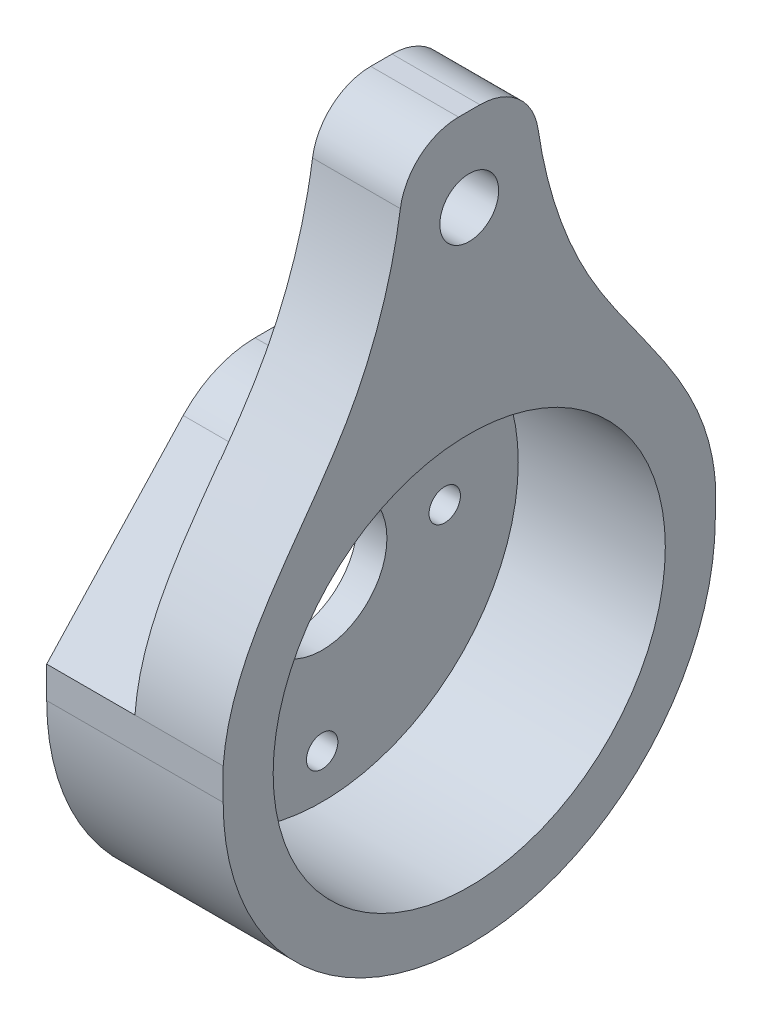
ISO-10303-21;
HEADER;
FILE_DESCRIPTION(('STEP AP214'),'2;1');
FILE_NAME('part.step','',(''),(''),'','','');
FILE_SCHEMA(('AUTOMOTIVE_DESIGN { 1 0 10303 214 1 1 1 1 }'));
ENDSEC;
DATA;
#1=APPLICATION_CONTEXT('core data for automotive mechanical design processes');
#2=APPLICATION_PROTOCOL_DEFINITION('international standard','automotive_design',2000,#1);
#3=PRODUCT_CONTEXT('',#1,'mechanical');
#4=PRODUCT('Part','Part','',(#3));
#5=PRODUCT_RELATED_PRODUCT_CATEGORY('part','',(#4));
#6=PRODUCT_DEFINITION_FORMATION('','',#4);
#7=PRODUCT_DEFINITION_CONTEXT('part definition',#1,'design');
#8=PRODUCT_DEFINITION('design','',#6,#7);
#9=PRODUCT_DEFINITION_SHAPE('','',#8);
#10=(LENGTH_UNIT() NAMED_UNIT(*) SI_UNIT(.MILLI.,.METRE.));
#11=(NAMED_UNIT(*) PLANE_ANGLE_UNIT() SI_UNIT($,.RADIAN.));
#12=(NAMED_UNIT(*) SI_UNIT($,.STERADIAN.) SOLID_ANGLE_UNIT());
#13=UNCERTAINTY_MEASURE_WITH_UNIT(LENGTH_MEASURE(1.E-05),#10,'distance_accuracy_value','');
#14=(GEOMETRIC_REPRESENTATION_CONTEXT(3) GLOBAL_UNCERTAINTY_ASSIGNED_CONTEXT((#13)) GLOBAL_UNIT_ASSIGNED_CONTEXT((#10,
#11,#12)) REPRESENTATION_CONTEXT('',''));
#15=CARTESIAN_POINT('',(0.,0.,0.));
#16=DIRECTION('',(0.,0.,1.));
#17=DIRECTION('',(1.,0.,0.));
#18=AXIS2_PLACEMENT_3D('',#15,#16,#17);
#19=CARTESIAN_POINT('',(1.5,10.8267780737383,-2.98337884698565));
#20=DIRECTION('',(1.,0.,0.));
#21=DIRECTION('',(0.,0.,-1.));
#22=AXIS2_PLACEMENT_3D('',#19,#20,#21);
#23=PLANE('',#22);
#24=CARTESIAN_POINT('',(1.5,10.8267780737383,-2.98337884698565));
#25=DIRECTION('',(1.,0.,0.));
#26=DIRECTION('',(0.,0.,-1.));
#27=AXIS2_PLACEMENT_3D('',#24,#25,#26);
#28=CIRCLE('',#27,3.30176779282932);
#29=CARTESIAN_POINT('',(1.5,10.8267780737383,-6.28514663981497));
#30=VERTEX_POINT('',#29);
#31=EDGE_CURVE('E221',#30,#30,#28,.T.);
#32=ORIENTED_EDGE('',*,*,#31,.F.);
#33=EDGE_LOOP('',(#32));
#34=FACE_BOUND('',#33,.T.);
#35=CARTESIAN_POINT('',(1.5,3.07677807373827,-2.98337884698565));
#36=DIRECTION('',(1.,0.,0.));
#37=DIRECTION('',(0.,0.,-1.));
#38=AXIS2_PLACEMENT_3D('',#35,#36,#37);
#39=CIRCLE('',#38,0.799999999999999);
#40=CARTESIAN_POINT('',(1.5,3.07677807373827,-3.78337884698565));
#41=VERTEX_POINT('',#40);
#42=EDGE_CURVE('E233',#41,#41,#39,.T.);
#43=ORIENTED_EDGE('',*,*,#42,.F.);
#44=EDGE_LOOP('',(#43));
#45=FACE_BOUND('',#44,.T.);
#46=CARTESIAN_POINT('',(1.5,10.8267780737383,-2.98337884698565));
#47=DIRECTION('',(1.,0.,0.));
#48=DIRECTION('',(0.,0.,-1.));
#49=AXIS2_PLACEMENT_3D('',#46,#47,#48);
#50=CIRCLE('',#49,10.);
#51=CARTESIAN_POINT('',(1.5,10.8267780737383,-12.9833788469857));
#52=VERTEX_POINT('',#51);
#53=EDGE_CURVE('E210',#52,#52,#50,.T.);
#54=ORIENTED_EDGE('',*,*,#53,.T.);
#55=EDGE_LOOP('',(#54));
#56=FACE_BOUND('',#55,.T.);
#57=CARTESIAN_POINT('',(1.5,18.5767780737383,-2.98337884698565));
#58=DIRECTION('',(1.,0.,0.));
#59=DIRECTION('',(0.,0.,-1.));
#60=AXIS2_PLACEMENT_3D('',#57,#58,#59);
#61=CIRCLE('',#60,0.8);
#62=CARTESIAN_POINT('',(1.5,18.5767780737383,-3.78337884698565));
#63=VERTEX_POINT('',#62);
#64=EDGE_CURVE('E239',#63,#63,#61,.T.);
#65=ORIENTED_EDGE('',*,*,#64,.F.);
#66=EDGE_LOOP('',(#65));
#67=FACE_BOUND('',#66,.T.);
#68=CARTESIAN_POINT('',(1.5,10.8267780737383,3.26662115301435));
#69=DIRECTION('',(1.,0.,0.));
#70=DIRECTION('',(0.,0.,-1.));
#71=AXIS2_PLACEMENT_3D('',#68,#69,#70);
#72=CIRCLE('',#71,0.8);
#73=CARTESIAN_POINT('',(1.5,10.8267780737383,2.46662115301435));
#74=VERTEX_POINT('',#73);
#75=EDGE_CURVE('E227',#74,#74,#72,.T.);
#76=ORIENTED_EDGE('',*,*,#75,.F.);
#77=EDGE_LOOP('',(#76));
#78=FACE_BOUND('',#77,.T.);
#79=CARTESIAN_POINT('',(1.5,10.8267780737383,-9.23337884698565));
#80=DIRECTION('',(1.,0.,0.));
#81=DIRECTION('',(0.,0.,-1.));
#82=AXIS2_PLACEMENT_3D('',#79,#80,#81);
#83=CIRCLE('',#82,0.800000000000001);
#84=CARTESIAN_POINT('',(1.5,10.8267780737383,-10.0333788469857));
#85=VERTEX_POINT('',#84);
#86=EDGE_CURVE('E215',#85,#85,#83,.T.);
#87=ORIENTED_EDGE('',*,*,#86,.F.);
#88=EDGE_LOOP('',(#87));
#89=FACE_BOUND('',#88,.T.);
#90=ADVANCED_FACE('F35',(#34,#45,#56,#67,#78,#89),#23,.T.);
#91=CARTESIAN_POINT('',(0.,10.8267780737383,-2.98337884698565));
#92=DIRECTION('',(1.,0.,0.));
#93=DIRECTION('',(0.,0.,-1.));
#94=AXIS2_PLACEMENT_3D('',#91,#92,#93);
#95=PLANE('',#94);
#96=CARTESIAN_POINT('',(0.,18.5767780737383,-2.98337884698565));
#97=DIRECTION('',(1.,0.,0.));
#98=DIRECTION('',(0.,0.,-1.));
#99=AXIS2_PLACEMENT_3D('',#96,#97,#98);
#100=CIRCLE('',#99,0.8);
#101=CARTESIAN_POINT('',(0.,18.5767780737383,-3.78337884698565));
#102=VERTEX_POINT('',#101);
#103=EDGE_CURVE('E236',#102,#102,#100,.T.);
#104=ORIENTED_EDGE('',*,*,#103,.T.);
#105=EDGE_LOOP('',(#104));
#106=FACE_BOUND('',#105,.T.);
#107=CARTESIAN_POINT('',(0.,3.07677807373827,-2.98337884698565));
#108=DIRECTION('',(1.,0.,0.));
#109=DIRECTION('',(0.,0.,-1.));
#110=AXIS2_PLACEMENT_3D('',#107,#108,#109);
#111=CIRCLE('',#110,0.799999999999999);
#112=CARTESIAN_POINT('',(0.,3.07677807373827,-3.78337884698565));
#113=VERTEX_POINT('',#112);
#114=EDGE_CURVE('E230',#113,#113,#111,.T.);
#115=ORIENTED_EDGE('',*,*,#114,.T.);
#116=EDGE_LOOP('',(#115));
#117=FACE_BOUND('',#116,.T.);
#118=CARTESIAN_POINT('',(0.,10.8267780737383,3.26662115301435));
#119=DIRECTION('',(1.,0.,0.));
#120=DIRECTION('',(0.,0.,-1.));
#121=AXIS2_PLACEMENT_3D('',#118,#119,#120);
#122=CIRCLE('',#121,0.8);
#123=CARTESIAN_POINT('',(0.,10.8267780737383,2.46662115301435));
#124=VERTEX_POINT('',#123);
#125=EDGE_CURVE('E224',#124,#124,#122,.T.);
#126=ORIENTED_EDGE('',*,*,#125,.T.);
#127=EDGE_LOOP('',(#126));
#128=FACE_BOUND('',#127,.T.);
#129=CARTESIAN_POINT('',(0.,10.8267780737383,-2.98337884698565));
#130=DIRECTION('',(1.,0.,0.));
#131=DIRECTION('',(0.,0.,-1.));
#132=AXIS2_PLACEMENT_3D('',#129,#130,#131);
#133=CIRCLE('',#132,3.30176779282932);
#134=CARTESIAN_POINT('',(0.,10.8267780737383,-6.28514663981497));
#135=VERTEX_POINT('',#134);
#136=EDGE_CURVE('E218',#135,#135,#133,.T.);
#137=ORIENTED_EDGE('',*,*,#136,.T.);
#138=EDGE_LOOP('',(#137));
#139=FACE_BOUND('',#138,.T.);
#140=CARTESIAN_POINT('',(0.,10.8267780737383,-9.23337884698565));
#141=DIRECTION('',(1.,0.,0.));
#142=DIRECTION('',(0.,0.,-1.));
#143=AXIS2_PLACEMENT_3D('',#140,#141,#142);
#144=CIRCLE('',#143,0.800000000000001);
#145=CARTESIAN_POINT('',(0.,10.8267780737383,-10.0333788469857));
#146=VERTEX_POINT('',#145);
#147=EDGE_CURVE('E214',#146,#146,#144,.T.);
#148=ORIENTED_EDGE('',*,*,#147,.T.);
#149=EDGE_LOOP('',(#148));
#150=FACE_BOUND('',#149,.T.);
#151=DIRECTION('',(0.,0.,-1.));
#152=VECTOR('',#151,1.);
#153=CARTESIAN_POINT('',(0.,21.5354502399734,-2.98337884698565));
#154=LINE('',#153,#152);
#155=CARTESIAN_POINT('',(0.,21.5354502399734,-1.06076843025892));
#156=VERTEX_POINT('',#155);
#157=CARTESIAN_POINT('',(0.,21.5354502399734,-5.02947655126927));
#158=VERTEX_POINT('',#157);
#159=EDGE_CURVE('E300',#156,#158,#154,.T.);
#160=ORIENTED_EDGE('',*,*,#159,.T.);
#161=CARTESIAN_POINT('',(0.,16.5354502399734,-5.02947655126927));
#162=DIRECTION('',(1.,0.,0.));
#163=DIRECTION('',(0.,0.,-1.));
#164=AXIS2_PLACEMENT_3D('',#161,#162,#163);
#165=CIRCLE('',#164,5.);
#166=CARTESIAN_POINT('',(0.,19.9038829928331,-8.72456258402437));
#167=VERTEX_POINT('',#166);
#168=EDGE_CURVE('E288',#158,#167,#165,.F.);
#169=ORIENTED_EDGE('',*,*,#168,.T.);
#170=DIRECTION('',(0.,0.739017206551019,0.673686550571947));
#171=VECTOR('',#170,1.);
#172=CARTESIAN_POINT('',(0.,12.4363789702301,-15.5319237412132));
#173=LINE('',#172,#171);
#174=CARTESIAN_POINT('',(0.,12.4363789702301,-15.5319237412132));
#175=VERTEX_POINT('',#174);
#176=EDGE_CURVE('E157',#175,#167,#173,.T.);
#177=ORIENTED_EDGE('',*,*,#176,.F.);
#178=DIRECTION('',(0.,-1.,0.));
#179=VECTOR('',#178,1.);
#180=CARTESIAN_POINT('',(0.,35.0946986657927,-15.5319237412449));
#181=LINE('',#180,#179);
#182=CARTESIAN_POINT('',(0.,10.8267780737383,-15.5319237412449));
#183=VERTEX_POINT('',#182);
#184=EDGE_CURVE('E166',#175,#183,#181,.T.);
#185=ORIENTED_EDGE('',*,*,#184,.T.);
#186=CARTESIAN_POINT('',(0.,10.8267780737383,-2.98337884698565));
#187=DIRECTION('',(-1.,0.,0.));
#188=DIRECTION('',(0.,0.,1.));
#189=AXIS2_PLACEMENT_3D('',#186,#187,#188);
#190=CIRCLE('',#189,12.5485448942593);
#191=CARTESIAN_POINT('',(0.,10.8267780737383,9.56516604727364));
#192=VERTEX_POINT('',#191);
#193=EDGE_CURVE('E189',#183,#192,#190,.T.);
#194=ORIENTED_EDGE('',*,*,#193,.T.);
#195=DIRECTION('',(0.,1.,0.));
#196=VECTOR('',#195,1.);
#197=CARTESIAN_POINT('',(0.,35.0946986657927,9.56516604727364));
#198=LINE('',#197,#196);
#199=CARTESIAN_POINT('',(0.,12.4363789702302,9.56516604724188));
#200=VERTEX_POINT('',#199);
#201=EDGE_CURVE('E204',#192,#200,#198,.T.);
#202=ORIENTED_EDGE('',*,*,#201,.T.);
#203=DIRECTION('',(0.,-0.73296647529922,0.68026476175636));
#204=VECTOR('',#203,1.);
#205=CARTESIAN_POINT('',(0.,12.4363789702302,9.56516604724188));
#206=LINE('',#205,#204);
#207=CARTESIAN_POINT('',(0.,19.9367740487552,2.60406394623718));
#208=VERTEX_POINT('',#207);
#209=EDGE_CURVE('E432',#208,#200,#206,.T.);
#210=ORIENTED_EDGE('',*,*,#209,.F.);
#211=CARTESIAN_POINT('',(0.,16.5354502399734,-1.06076843025892));
#212=DIRECTION('',(1.,0.,0.));
#213=DIRECTION('',(0.,0.,-1.));
#214=AXIS2_PLACEMENT_3D('',#211,#212,#213);
#215=CIRCLE('',#214,5.);
#216=EDGE_CURVE('E286',#208,#156,#215,.F.);
#217=ORIENTED_EDGE('',*,*,#216,.T.);
#218=EDGE_LOOP('',(#160,#169,#177,#185,#194,#202,#210,#217));
#219=FACE_BOUND('',#218,.T.);
#220=ADVANCED_FACE('F303',(#106,#117,#128,#139,#150,#219),#95,.F.);
#221=CARTESIAN_POINT('',(1.5,18.5767780737383,-2.98337884698565));
#222=DIRECTION('',(-1.,0.,0.));
#223=DIRECTION('',(0.,0.,1.));
#224=AXIS2_PLACEMENT_3D('',#221,#222,#223);
#225=CYLINDRICAL_SURFACE('',#224,0.8);
#226=ORIENTED_EDGE('',*,*,#64,.T.);
#227=EDGE_LOOP('',(#226));
#228=FACE_BOUND('',#227,.T.);
#229=ORIENTED_EDGE('',*,*,#103,.F.);
#230=EDGE_LOOP('',(#229));
#231=FACE_BOUND('',#230,.T.);
#232=ADVANCED_FACE('F370',(#228,#231),#225,.F.);
#233=CARTESIAN_POINT('',(1.5,3.07677807373827,-2.98337884698565));
#234=DIRECTION('',(-1.,0.,0.));
#235=DIRECTION('',(0.,0.,1.));
#236=AXIS2_PLACEMENT_3D('',#233,#234,#235);
#237=CYLINDRICAL_SURFACE('',#236,0.799999999999999);
#238=ORIENTED_EDGE('',*,*,#42,.T.);
#239=EDGE_LOOP('',(#238));
#240=FACE_BOUND('',#239,.T.);
#241=ORIENTED_EDGE('',*,*,#114,.F.);
#242=EDGE_LOOP('',(#241));
#243=FACE_BOUND('',#242,.T.);
#244=ADVANCED_FACE('F366',(#240,#243),#237,.F.);
#245=CARTESIAN_POINT('',(1.5,10.8267780737383,3.26662115301435));
#246=DIRECTION('',(-1.,0.,0.));
#247=DIRECTION('',(0.,0.,1.));
#248=AXIS2_PLACEMENT_3D('',#245,#246,#247);
#249=CYLINDRICAL_SURFACE('',#248,0.8);
#250=ORIENTED_EDGE('',*,*,#75,.T.);
#251=EDGE_LOOP('',(#250));
#252=FACE_BOUND('',#251,.T.);
#253=ORIENTED_EDGE('',*,*,#125,.F.);
#254=EDGE_LOOP('',(#253));
#255=FACE_BOUND('',#254,.T.);
#256=ADVANCED_FACE('F362',(#252,#255),#249,.F.);
#257=CARTESIAN_POINT('',(1.5,10.8267780737383,-2.98337884698565));
#258=DIRECTION('',(-1.,0.,0.));
#259=DIRECTION('',(0.,0.,1.));
#260=AXIS2_PLACEMENT_3D('',#257,#258,#259);
#261=CYLINDRICAL_SURFACE('',#260,3.30176779282932);
#262=ORIENTED_EDGE('',*,*,#31,.T.);
#263=EDGE_LOOP('',(#262));
#264=FACE_BOUND('',#263,.T.);
#265=ORIENTED_EDGE('',*,*,#136,.F.);
#266=EDGE_LOOP('',(#265));
#267=FACE_BOUND('',#266,.T.);
#268=ADVANCED_FACE('F358',(#264,#267),#261,.F.);
#269=CARTESIAN_POINT('',(1.5,10.8267780737383,-9.23337884698565));
#270=DIRECTION('',(-1.,0.,0.));
#271=DIRECTION('',(0.,0.,1.));
#272=AXIS2_PLACEMENT_3D('',#269,#270,#271);
#273=CYLINDRICAL_SURFACE('',#272,0.800000000000001);
#274=ORIENTED_EDGE('',*,*,#86,.T.);
#275=EDGE_LOOP('',(#274));
#276=FACE_BOUND('',#275,.T.);
#277=ORIENTED_EDGE('',*,*,#147,.F.);
#278=EDGE_LOOP('',(#277));
#279=FACE_BOUND('',#278,.T.);
#280=ADVANCED_FACE('F354',(#276,#279),#273,.F.);
#281=CARTESIAN_POINT('',(9.,10.8267780737383,-2.98337884698565));
#282=DIRECTION('',(-1.,0.,0.));
#283=DIRECTION('',(0.,0.,1.));
#284=AXIS2_PLACEMENT_3D('',#281,#282,#283);
#285=CYLINDRICAL_SURFACE('',#284,12.5485448942593);
#286=ORIENTED_EDGE('',*,*,#193,.F.);
#287=DIRECTION('',(-1.,0.,0.));
#288=VECTOR('',#287,1.);
#289=CARTESIAN_POINT('',(9.,10.8267780737383,-15.5319237412449));
#290=LINE('',#289,#288);
#291=CARTESIAN_POINT('',(9.,10.8267780737383,-15.5319237412449));
#292=VERTEX_POINT('',#291);
#293=EDGE_CURVE('E208',#292,#183,#290,.T.);
#294=ORIENTED_EDGE('',*,*,#293,.F.);
#295=CARTESIAN_POINT('',(9.,10.8267780737383,-2.98337884698565));
#296=DIRECTION('',(-1.,0.,0.));
#297=DIRECTION('',(0.,0.,1.));
#298=AXIS2_PLACEMENT_3D('',#295,#296,#297);
#299=CIRCLE('',#298,12.5485448942593);
#300=CARTESIAN_POINT('',(9.,10.8267780737383,9.56516604727364));
#301=VERTEX_POINT('',#300);
#302=EDGE_CURVE('E190',#292,#301,#299,.T.);
#303=ORIENTED_EDGE('',*,*,#302,.T.);
#304=DIRECTION('',(-1.,0.,0.));
#305=VECTOR('',#304,1.);
#306=CARTESIAN_POINT('',(9.,10.8267780737383,9.56516604727364));
#307=LINE('',#306,#305);
#308=EDGE_CURVE('E201',#301,#192,#307,.T.);
#309=ORIENTED_EDGE('',*,*,#308,.T.);
#310=EDGE_LOOP('',(#286,#294,#303,#309));
#311=FACE_BOUND('',#310,.T.);
#312=ADVANCED_FACE('F345',(#311),#285,.T.);
#313=CARTESIAN_POINT('',(9.,35.0946986657927,-15.5319237412449));
#314=DIRECTION('',(0.,0.,-1.));
#315=DIRECTION('',(-1.,0.,0.));
#316=AXIS2_PLACEMENT_3D('',#313,#314,#315);
#317=PLANE('',#316);
#318=DIRECTION('',(1.,0.,0.));
#319=VECTOR('',#318,1.);
#320=CARTESIAN_POINT('',(0.,12.4363789698143,-15.5319237412449));
#321=LINE('',#320,#319);
#322=CARTESIAN_POINT('',(9.,12.4363789702301,-15.5319237412132));
#323=VERTEX_POINT('',#322);
#324=CARTESIAN_POINT('',(4.5,12.4363789702301,-15.5319237412132));
#325=VERTEX_POINT('',#324);
#326=EDGE_CURVE('E163',#323,#325,#321,.F.);
#327=ORIENTED_EDGE('',*,*,#326,.F.);
#328=DIRECTION('',(0.,-1.,0.));
#329=VECTOR('',#328,1.);
#330=CARTESIAN_POINT('',(9.,35.0946986657927,-15.5319237412449));
#331=LINE('',#330,#329);
#332=EDGE_CURVE('E199',#323,#292,#331,.T.);
#333=ORIENTED_EDGE('',*,*,#332,.T.);
#334=ORIENTED_EDGE('',*,*,#293,.T.);
#335=ORIENTED_EDGE('',*,*,#184,.F.);
#336=DIRECTION('',(-1.,0.,0.));
#337=VECTOR('',#336,1.);
#338=CARTESIAN_POINT('',(4.5,12.4363789702301,-15.5319237412132));
#339=LINE('',#338,#337);
#340=EDGE_CURVE('E155',#325,#175,#339,.T.);
#341=ORIENTED_EDGE('',*,*,#340,.F.);
#342=EDGE_LOOP('',(#327,#333,#334,#335,#341));
#343=FACE_BOUND('',#342,.T.);
#344=ADVANCED_FACE('F162',(#343),#317,.T.);
#345=CARTESIAN_POINT('',(9.,35.0946986657927,-15.5319237412449));
#346=DIRECTION('',(0.,1.,0.));
#347=DIRECTION('',(0.,0.,1.));
#348=AXIS2_PLACEMENT_3D('',#345,#346,#347);
#349=PLANE('',#348);
#350=DIRECTION('',(0.,0.,-1.));
#351=VECTOR('',#350,1.);
#352=CARTESIAN_POINT('',(4.51973514538148,35.0946986657927,-15.5319237412449));
#353=LINE('',#352,#351);
#354=CARTESIAN_POINT('',(4.51973514538148,35.0946986657927,-2.43857785067727));
#355=VERTEX_POINT('',#354);
#356=CARTESIAN_POINT('',(4.51973514538148,35.0946986657927,-3.52817984329402));
#357=VERTEX_POINT('',#356);
#358=EDGE_CURVE('E454',#355,#357,#353,.T.);
#359=ORIENTED_EDGE('',*,*,#358,.F.);
#360=DIRECTION('',(-1.,0.,0.));
#361=VECTOR('',#360,1.);
#362=CARTESIAN_POINT('',(9.,35.0946986657927,-2.43857785067728));
#363=LINE('',#362,#361);
#364=CARTESIAN_POINT('',(9.,35.0946986657927,-2.43857785067727));
#365=VERTEX_POINT('',#364);
#366=EDGE_CURVE('E264',#355,#365,#363,.F.);
#367=ORIENTED_EDGE('',*,*,#366,.T.);
#368=DIRECTION('',(0.,0.,-1.));
#369=VECTOR('',#368,1.);
#370=CARTESIAN_POINT('',(9.,35.0946986657927,-15.5319237412449));
#371=LINE('',#370,#369);
#372=CARTESIAN_POINT('',(9.,35.0946986657927,-3.52817984329402));
#373=VERTEX_POINT('',#372);
#374=EDGE_CURVE('E196',#365,#373,#371,.T.);
#375=ORIENTED_EDGE('',*,*,#374,.T.);
#376=DIRECTION('',(-1.,0.,0.));
#377=VECTOR('',#376,1.);
#378=CARTESIAN_POINT('',(0.,35.0946986657927,-3.52817984329402));
#379=LINE('',#378,#377);
#380=EDGE_CURVE('E266',#373,#357,#379,.T.);
#381=ORIENTED_EDGE('',*,*,#380,.T.);
#382=EDGE_LOOP('',(#359,#367,#375,#381));
#383=FACE_BOUND('',#382,.T.);
#384=ADVANCED_FACE('F344',(#383),#349,.T.);
#385=CARTESIAN_POINT('',(9.,35.0946986657927,9.56516604727364));
#386=DIRECTION('',(0.,0.,1.));
#387=DIRECTION('',(0.,-1.,0.));
#388=AXIS2_PLACEMENT_3D('',#385,#386,#387);
#389=PLANE('',#388);
#390=DIRECTION('',(1.,0.,0.));
#391=VECTOR('',#390,1.);
#392=CARTESIAN_POINT('',(0.,12.4363789698143,9.56516604727365));
#393=LINE('',#392,#391);
#394=CARTESIAN_POINT('',(4.5,12.4363789702302,9.56516604724188));
#395=VERTEX_POINT('',#394);
#396=EDGE_CURVE('E174',#200,#395,#393,.T.);
#397=ORIENTED_EDGE('',*,*,#396,.F.);
#398=ORIENTED_EDGE('',*,*,#201,.F.);
#399=ORIENTED_EDGE('',*,*,#308,.F.);
#400=DIRECTION('',(0.,1.,0.));
#401=VECTOR('',#400,1.);
#402=CARTESIAN_POINT('',(9.,35.0946986657927,9.56516604727364));
#403=LINE('',#402,#401);
#404=CARTESIAN_POINT('',(9.,12.4363789702302,9.56516604727364));
#405=VERTEX_POINT('',#404);
#406=EDGE_CURVE('E193',#301,#405,#403,.T.);
#407=ORIENTED_EDGE('',*,*,#406,.T.);
#408=EDGE_CURVE('E171',#395,#405,#393,.T.);
#409=ORIENTED_EDGE('',*,*,#408,.F.);
#410=EDGE_LOOP('',(#397,#398,#399,#407,#409));
#411=FACE_BOUND('',#410,.T.);
#412=ADVANCED_FACE('F340',(#411),#389,.T.);
#413=CARTESIAN_POINT('',(9.,10.8267780737383,-2.98337884698565));
#414=DIRECTION('',(-1.,0.,0.));
#415=DIRECTION('',(0.,0.,1.));
#416=AXIS2_PLACEMENT_3D('',#413,#414,#415);
#417=PLANE('',#416);
#418=CARTESIAN_POINT('',(9.,30.8267780737383,-2.98337884698565));
#419=DIRECTION('',(-1.,0.,0.));
#420=DIRECTION('',(0.,0.,1.));
#421=AXIS2_PLACEMENT_3D('',#418,#419,#420);
#422=CIRCLE('',#421,1.5);
#423=CARTESIAN_POINT('',(9.,30.8267780737383,-1.48337884698565));
#424=VERTEX_POINT('',#423);
#425=EDGE_CURVE('E172',#424,#424,#422,.T.);
#426=ORIENTED_EDGE('',*,*,#425,.T.);
#427=EDGE_LOOP('',(#426));
#428=FACE_BOUND('',#427,.T.);
#429=CARTESIAN_POINT('',(9.,10.8267780737383,-2.98337884698565));
#430=DIRECTION('',(-1.,0.,0.));
#431=DIRECTION('',(0.,0.,1.));
#432=AXIS2_PLACEMENT_3D('',#429,#430,#431);
#433=CIRCLE('',#432,10.);
#434=CARTESIAN_POINT('',(9.,10.8267780737383,7.01662115301436));
#435=VERTEX_POINT('',#434);
#436=EDGE_CURVE('E186',#435,#435,#433,.T.);
#437=ORIENTED_EDGE('',*,*,#436,.T.);
#438=EDGE_LOOP('',(#437));
#439=FACE_BOUND('',#438,.T.);
#440=CARTESIAN_POINT('',(9.,36.1504126638392,-6.2211046210945));
#441=CARTESIAN_POINT('',(9.,32.1518411633712,-6.24618892813339));
#442=CARTESIAN_POINT('',(9.,22.9023980787727,-8.38368120486761));
#443=CARTESIAN_POINT('',(9.,16.6219470727352,-15.9635346263223));
#444=CARTESIAN_POINT('',(9.,10.8267780737383,-15.5319237412449));
#445=B_SPLINE_CURVE_WITH_KNOTS('',3,(#440,#441,#442,#443,#444),.UNSPECIFIED.,.F.,.F.,(4,1,4),
(0.,0.436725836026016,1.),.UNSPECIFIED.);
#446=CARTESIAN_POINT('',(9.,32.5327555088935,-6.49602522373631));
#447=VERTEX_POINT('',#446);
#448=EDGE_CURVE('E170',#323,#447,#445,.F.);
#449=ORIENTED_EDGE('',*,*,#448,.T.);
#450=CARTESIAN_POINT('',(9.,32.0946986657927,-3.52817984329402));
#451=DIRECTION('',(-1.,0.,0.));
#452=DIRECTION('',(0.,0.,1.));
#453=AXIS2_PLACEMENT_3D('',#450,#451,#452);
#454=CIRCLE('',#453,3.);
#455=EDGE_CURVE('E262',#447,#373,#454,.F.);
#456=ORIENTED_EDGE('',*,*,#455,.T.);
#457=ORIENTED_EDGE('',*,*,#374,.F.);
#458=CARTESIAN_POINT('',(9.,32.0946986657927,-2.43857785067727));
#459=DIRECTION('',(-1.,0.,0.));
#460=DIRECTION('',(0.,0.,1.));
#461=AXIS2_PLACEMENT_3D('',#458,#459,#460);
#462=CIRCLE('',#461,3.);
#463=CARTESIAN_POINT('',(9.,32.5327555088935,0.529267529765014));
#464=VERTEX_POINT('',#463);
#465=EDGE_CURVE('E260',#365,#464,#462,.F.);
#466=ORIENTED_EDGE('',*,*,#465,.T.);
#467=CARTESIAN_POINT('',(9.,10.8267780737383,9.56516604727364));
#468=CARTESIAN_POINT('',(9.,16.6219470727352,9.99677693235098));
#469=CARTESIAN_POINT('',(9.,22.9023980787727,2.41692351089631));
#470=CARTESIAN_POINT('',(9.,32.1518411633712,0.279431234162096));
#471=CARTESIAN_POINT('',(9.,36.1504126638392,0.2543469271232));
#472=B_SPLINE_CURVE_WITH_KNOTS('',3,(#467,#468,#469,#470,#471),.UNSPECIFIED.,.F.,.F.,(4,1,4),
(0.,0.563274163973984,1.),.UNSPECIFIED.);
#473=EDGE_CURVE('E247',#464,#405,#472,.F.);
#474=ORIENTED_EDGE('',*,*,#473,.T.);
#475=ORIENTED_EDGE('',*,*,#406,.F.);
#476=ORIENTED_EDGE('',*,*,#302,.F.);
#477=ORIENTED_EDGE('',*,*,#332,.F.);
#478=EDGE_LOOP('',(#449,#456,#457,#466,#474,#475,#476,#477));
#479=FACE_BOUND('',#478,.T.);
#480=ADVANCED_FACE('F336',(#428,#439,#479),#417,.F.);
#481=CARTESIAN_POINT('',(9.,10.8267780737383,-2.98337884698565));
#482=DIRECTION('',(-1.,0.,0.));
#483=DIRECTION('',(0.,0.,1.));
#484=AXIS2_PLACEMENT_3D('',#481,#482,#483);
#485=CYLINDRICAL_SURFACE('',#484,10.);
#486=ORIENTED_EDGE('',*,*,#53,.F.);
#487=EDGE_LOOP('',(#486));
#488=FACE_BOUND('',#487,.T.);
#489=ORIENTED_EDGE('',*,*,#436,.F.);
#490=EDGE_LOOP('',(#489));
#491=FACE_BOUND('',#490,.T.);
#492=ADVANCED_FACE('F332',(#488,#491),#485,.F.);
#493=CARTESIAN_POINT('',(0.,30.8267780737383,-2.98337884698565));
#494=DIRECTION('',(1.,0.,0.));
#495=DIRECTION('',(0.,0.,-1.));
#496=AXIS2_PLACEMENT_3D('',#493,#494,#495);
#497=CYLINDRICAL_SURFACE('',#496,1.5);
#498=CARTESIAN_POINT('',(4.51973514538148,30.8267780737383,-2.98337884698565));
#499=DIRECTION('',(1.,0.,0.));
#500=DIRECTION('',(0.,0.,-1.));
#501=AXIS2_PLACEMENT_3D('',#498,#499,#500);
#502=CIRCLE('',#501,1.5);
#503=CARTESIAN_POINT('',(4.51973514538148,30.8267780737383,-4.48337884698565));
#504=VERTEX_POINT('',#503);
#505=EDGE_CURVE('E305',#504,#504,#502,.F.);
#506=ORIENTED_EDGE('',*,*,#505,.T.);
#507=EDGE_LOOP('',(#506));
#508=FACE_BOUND('',#507,.T.);
#509=ORIENTED_EDGE('',*,*,#425,.F.);
#510=EDGE_LOOP('',(#509));
#511=FACE_BOUND('',#510,.T.);
#512=ADVANCED_FACE('F329',(#508,#511),#497,.F.);
#513=CARTESIAN_POINT('',(0.,36.1504126638392,-6.2211046210945));
#514=CARTESIAN_POINT('',(0.,32.1518411633712,-6.24618892813339));
#515=CARTESIAN_POINT('',(0.,22.9023980787727,-8.38368120486761));
#516=CARTESIAN_POINT('',(0.,16.6219470727352,-15.9635346263223));
#517=CARTESIAN_POINT('',(0.,10.8267780737383,-15.5319237412449));
#518=B_SPLINE_CURVE_WITH_KNOTS('',3,(#513,#514,#515,#516,#517),.UNSPECIFIED.,.F.,.F.,(4,1,4),
(0.,0.436725836026016,1.),.UNSPECIFIED.);
#519=DIRECTION('',(1.,0.,0.));
#520=VECTOR('',#519,1.);
#521=SURFACE_OF_LINEAR_EXTRUSION('',#518,#520);
#522=ORIENTED_EDGE('',*,*,#326,.T.);
#523=CARTESIAN_POINT('',(4.5,36.1504126638392,-6.2211046210945));
#524=CARTESIAN_POINT('',(4.5,32.1518411633712,-6.24618892813339));
#525=CARTESIAN_POINT('',(4.5,22.9023980787727,-8.38368120486761));
#526=CARTESIAN_POINT('',(4.5,16.6219470727352,-15.9635346263223));
#527=CARTESIAN_POINT('',(4.5,10.8267780737383,-15.5319237412449));
#528=B_SPLINE_CURVE_WITH_KNOTS('',3,(#523,#524,#525,#526,#527),.UNSPECIFIED.,.F.,.F.,(4,1,4),
(0.,0.436725836026016,1.),.UNSPECIFIED.);
#529=CARTESIAN_POINT('',(4.5,21.5354502399734,-11.1893644560458));
#530=VERTEX_POINT('',#529);
#531=EDGE_CURVE('E141',#325,#530,#528,.F.);
#532=ORIENTED_EDGE('',*,*,#531,.T.);
#533=DIRECTION('',(1.,0.,0.));
#534=VECTOR('',#533,1.);
#535=CARTESIAN_POINT('',(0.,21.5354502399734,-11.1893644557882));
#536=LINE('',#535,#534);
#537=CARTESIAN_POINT('',(4.51973514538148,21.5354502399734,-11.1893644557882));
#538=VERTEX_POINT('',#537);
#539=EDGE_CURVE('E177',#530,#538,#536,.T.);
#540=ORIENTED_EDGE('',*,*,#539,.T.);
#541=CARTESIAN_POINT('',(4.51973514538148,36.1504126638392,-6.2211046210945));
#542=CARTESIAN_POINT('',(4.51973514538148,32.1518411633712,-6.24618892813339));
#543=CARTESIAN_POINT('',(4.51973514538148,22.9023980787727,-8.38368120486761));
#544=CARTESIAN_POINT('',(4.51973514538148,16.6219470727352,-15.9635346263223));
#545=CARTESIAN_POINT('',(4.51973514538148,10.8267780737383,-15.5319237412449));
#546=B_SPLINE_CURVE_WITH_KNOTS('',3,(#541,#542,#543,#544,#545),.UNSPECIFIED.,.F.,.F.,(4,1,4),
(0.,0.436725836026016,1.),.UNSPECIFIED.);
#547=CARTESIAN_POINT('',(4.51973514538148,32.5327555088935,-6.49602522373631));
#548=VERTEX_POINT('',#547);
#549=EDGE_CURVE('E309',#538,#548,#546,.F.);
#550=ORIENTED_EDGE('',*,*,#549,.T.);
#551=DIRECTION('',(1.,0.,0.));
#552=VECTOR('',#551,1.);
#553=CARTESIAN_POINT('',(0.,32.5327555088935,-6.49602522373631));
#554=LINE('',#553,#552);
#555=EDGE_CURVE('E255',#548,#447,#554,.T.);
#556=ORIENTED_EDGE('',*,*,#555,.T.);
#557=ORIENTED_EDGE('',*,*,#448,.F.);
#558=EDGE_LOOP('',(#522,#532,#540,#550,#556,#557));
#559=FACE_BOUND('',#558,.T.);
#560=ADVANCED_FACE('F168',(#559),#521,.F.);
#561=CARTESIAN_POINT('',(0.,10.8267780737383,9.56516604727364));
#562=CARTESIAN_POINT('',(0.,16.6219470727352,9.99677693235098));
#563=CARTESIAN_POINT('',(0.,22.9023980787727,2.41692351089631));
#564=CARTESIAN_POINT('',(0.,32.1518411633712,0.279431234162096));
#565=CARTESIAN_POINT('',(0.,36.1504126638392,0.2543469271232));
#566=B_SPLINE_CURVE_WITH_KNOTS('',3,(#561,#562,#563,#564,#565),.UNSPECIFIED.,.F.,.F.,(4,1,4),
(0.,0.563274163973984,1.),.UNSPECIFIED.);
#567=DIRECTION('',(1.,0.,0.));
#568=VECTOR('',#567,1.);
#569=SURFACE_OF_LINEAR_EXTRUSION('',#566,#568);
#570=DIRECTION('',(1.,0.,0.));
#571=VECTOR('',#570,1.);
#572=CARTESIAN_POINT('',(0.,21.5354502399734,5.22260676181691));
#573=LINE('',#572,#571);
#574=CARTESIAN_POINT('',(4.51973514538148,21.5354502399734,5.22260676181691));
#575=VERTEX_POINT('',#574);
#576=CARTESIAN_POINT('',(4.5,21.5354502399734,5.22260676181691));
#577=VERTEX_POINT('',#576);
#578=EDGE_CURVE('E274',#575,#577,#573,.F.);
#579=ORIENTED_EDGE('',*,*,#578,.T.);
#580=CARTESIAN_POINT('',(4.5,10.8267780737383,9.56516604727364));
#581=CARTESIAN_POINT('',(4.5,16.6219470727352,9.99677693235098));
#582=CARTESIAN_POINT('',(4.5,22.9023980787727,2.41692351089631));
#583=CARTESIAN_POINT('',(4.5,32.1518411633712,0.279431234162096));
#584=CARTESIAN_POINT('',(4.5,36.1504126638392,0.2543469271232));
#585=B_SPLINE_CURVE_WITH_KNOTS('',3,(#580,#581,#582,#583,#584),.UNSPECIFIED.,.F.,.F.,(4,1,4),
(0.,0.563274163973984,1.),.UNSPECIFIED.);
#586=EDGE_CURVE('E151',#577,#395,#585,.F.);
#587=ORIENTED_EDGE('',*,*,#586,.T.);
#588=ORIENTED_EDGE('',*,*,#408,.T.);
#589=ORIENTED_EDGE('',*,*,#473,.F.);
#590=DIRECTION('',(1.,0.,0.));
#591=VECTOR('',#590,1.);
#592=CARTESIAN_POINT('',(9.,32.5327555088935,0.529267529765013));
#593=LINE('',#592,#591);
#594=CARTESIAN_POINT('',(4.51973514538148,32.5327555088935,0.529267529765013));
#595=VERTEX_POINT('',#594);
#596=EDGE_CURVE('E269',#464,#595,#593,.F.);
#597=ORIENTED_EDGE('',*,*,#596,.T.);
#598=CARTESIAN_POINT('',(4.51973514538148,10.8267780737383,9.56516604727364));
#599=CARTESIAN_POINT('',(4.51973514538148,16.6219470727352,9.99677693235098));
#600=CARTESIAN_POINT('',(4.51973514538148,22.9023980787727,2.41692351089631));
#601=CARTESIAN_POINT('',(4.51973514538148,32.1518411633712,0.279431234162096));
#602=CARTESIAN_POINT('',(4.51973514538148,36.1504126638392,0.2543469271232));
#603=B_SPLINE_CURVE_WITH_KNOTS('',3,(#598,#599,#600,#601,#602),.UNSPECIFIED.,.F.,.F.,(4,1,4),
(0.,0.563274163973984,1.),.UNSPECIFIED.);
#604=EDGE_CURVE('E450',#595,#575,#603,.F.);
#605=ORIENTED_EDGE('',*,*,#604,.T.);
#606=EDGE_LOOP('',(#579,#587,#588,#589,#597,#605));
#607=FACE_BOUND('',#606,.T.);
#608=ADVANCED_FACE('F319',(#607),#569,.F.);
#609=CARTESIAN_POINT('',(4.5,32.0946986657927,-3.52817984329402));
#610=DIRECTION('',(1.,0.,0.));
#611=DIRECTION('',(0.,0.,-1.));
#612=AXIS2_PLACEMENT_3D('',#609,#610,#611);
#613=CYLINDRICAL_SURFACE('',#612,3.);
#614=CARTESIAN_POINT('',(4.51973514538148,32.0946986657927,-3.52817984329402));
#615=DIRECTION('',(1.,0.,0.));
#616=DIRECTION('',(0.,0.,-1.));
#617=AXIS2_PLACEMENT_3D('',#614,#615,#616);
#618=CIRCLE('',#617,3.);
#619=EDGE_CURVE('E459',#357,#548,#618,.F.);
#620=ORIENTED_EDGE('',*,*,#619,.F.);
#621=ORIENTED_EDGE('',*,*,#380,.F.);
#622=ORIENTED_EDGE('',*,*,#455,.F.);
#623=ORIENTED_EDGE('',*,*,#555,.F.);
#624=EDGE_LOOP('',(#620,#621,#622,#623));
#625=FACE_BOUND('',#624,.T.);
#626=ADVANCED_FACE('F323',(#625),#613,.T.);
#627=CARTESIAN_POINT('',(4.5,32.0946986657927,-2.43857785067727));
#628=DIRECTION('',(1.,0.,0.));
#629=DIRECTION('',(0.,0.,-1.));
#630=AXIS2_PLACEMENT_3D('',#627,#628,#629);
#631=CYLINDRICAL_SURFACE('',#630,3.);
#632=CARTESIAN_POINT('',(4.51973514538148,32.0946986657927,-2.43857785067727));
#633=DIRECTION('',(1.,0.,0.));
#634=DIRECTION('',(0.,0.,-1.));
#635=AXIS2_PLACEMENT_3D('',#632,#633,#634);
#636=CIRCLE('',#635,3.);
#637=EDGE_CURVE('E272',#595,#355,#636,.F.);
#638=ORIENTED_EDGE('',*,*,#637,.F.);
#639=ORIENTED_EDGE('',*,*,#596,.F.);
#640=ORIENTED_EDGE('',*,*,#465,.F.);
#641=ORIENTED_EDGE('',*,*,#366,.F.);
#642=EDGE_LOOP('',(#638,#639,#640,#641));
#643=FACE_BOUND('',#642,.T.);
#644=ADVANCED_FACE('F383',(#643),#631,.T.);
#645=CARTESIAN_POINT('',(4.51973514538148,21.5354502399734,-15.5319237412449));
#646=DIRECTION('',(0.,-1.,0.));
#647=DIRECTION('',(0.,0.,-1.));
#648=AXIS2_PLACEMENT_3D('',#645,#646,#647);
#649=PLANE('',#648);
#650=DIRECTION('',(0.,0.,-1.));
#651=VECTOR('',#650,1.);
#652=CARTESIAN_POINT('',(4.5,21.5354502399734,-7.23722927025502));
#653=LINE('',#652,#651);
#654=CARTESIAN_POINT('',(4.5,21.5354502399734,-5.02947655126927));
#655=VERTEX_POINT('',#654);
#656=EDGE_CURVE('E146',#655,#530,#653,.T.);
#657=ORIENTED_EDGE('',*,*,#656,.F.);
#658=DIRECTION('',(-1.,0.,0.));
#659=VECTOR('',#658,1.);
#660=CARTESIAN_POINT('',(4.51973514538148,21.5354502399734,-5.02947655126927));
#661=LINE('',#660,#659);
#662=EDGE_CURVE('E283',#655,#158,#661,.T.);
#663=ORIENTED_EDGE('',*,*,#662,.T.);
#664=ORIENTED_EDGE('',*,*,#159,.F.);
#665=DIRECTION('',(-1.,0.,0.));
#666=VECTOR('',#665,1.);
#667=CARTESIAN_POINT('',(4.51973514538148,21.5354502399734,-1.06076843025892));
#668=LINE('',#667,#666);
#669=CARTESIAN_POINT('',(4.5,21.5354502399734,-1.06076843025892));
#670=VERTEX_POINT('',#669);
#671=EDGE_CURVE('E280',#156,#670,#668,.F.);
#672=ORIENTED_EDGE('',*,*,#671,.T.);
#673=DIRECTION('',(0.,0.,1.));
#674=VECTOR('',#673,1.);
#675=CARTESIAN_POINT('',(4.5,21.5354502399734,-15.5319237412449));
#676=LINE('',#675,#674);
#677=EDGE_CURVE('E277',#670,#577,#676,.T.);
#678=ORIENTED_EDGE('',*,*,#677,.T.);
#679=ORIENTED_EDGE('',*,*,#578,.F.);
#680=DIRECTION('',(0.,0.,1.));
#681=VECTOR('',#680,1.);
#682=CARTESIAN_POINT('',(4.51973514538148,21.5354502399734,-15.5319237412449));
#683=LINE('',#682,#681);
#684=EDGE_CURVE('E150',#538,#575,#683,.T.);
#685=ORIENTED_EDGE('',*,*,#684,.F.);
#686=ORIENTED_EDGE('',*,*,#539,.F.);
#687=EDGE_LOOP('',(#657,#663,#664,#672,#678,#679,#685,#686));
#688=FACE_BOUND('',#687,.T.);
#689=ADVANCED_FACE('F299',(#688),#649,.F.);
#690=CARTESIAN_POINT('',(4.51973514538148,37.3541947863498,-15.5319237412449));
#691=DIRECTION('',(1.,0.,0.));
#692=DIRECTION('',(0.,0.,-1.));
#693=AXIS2_PLACEMENT_3D('',#690,#691,#692);
#694=PLANE('',#693);
#695=ORIENTED_EDGE('',*,*,#684,.T.);
#696=ORIENTED_EDGE('',*,*,#604,.F.);
#697=ORIENTED_EDGE('',*,*,#637,.T.);
#698=ORIENTED_EDGE('',*,*,#358,.T.);
#699=ORIENTED_EDGE('',*,*,#619,.T.);
#700=ORIENTED_EDGE('',*,*,#549,.F.);
#701=EDGE_LOOP('',(#695,#696,#697,#698,#699,#700));
#702=FACE_BOUND('',#701,.T.);
#703=ORIENTED_EDGE('',*,*,#505,.F.);
#704=EDGE_LOOP('',(#703));
#705=FACE_BOUND('',#704,.T.);
#706=ADVANCED_FACE('F325',(#702,#705),#694,.F.);
#707=CARTESIAN_POINT('',(4.5,0.,0.));
#708=DIRECTION('',(1.,0.,0.));
#709=DIRECTION('',(0.,0.,-1.));
#710=AXIS2_PLACEMENT_3D('',#707,#708,#709);
#711=PLANE('',#710);
#712=ORIENTED_EDGE('',*,*,#677,.F.);
#713=CARTESIAN_POINT('',(4.5,16.5354502399734,-1.06076843025892));
#714=DIRECTION('',(1.,0.,0.));
#715=DIRECTION('',(0.,0.,-1.));
#716=AXIS2_PLACEMENT_3D('',#713,#714,#715);
#717=CIRCLE('',#716,5.);
#718=CARTESIAN_POINT('',(4.5,19.9367740487552,2.60406394623718));
#719=VERTEX_POINT('',#718);
#720=EDGE_CURVE('E11',#670,#719,#717,.T.);
#721=ORIENTED_EDGE('',*,*,#720,.T.);
#722=DIRECTION('',(0.,-0.73296647529922,0.68026476175636));
#723=VECTOR('',#722,1.);
#724=CARTESIAN_POINT('',(4.5,12.4363789702302,9.56516604724188));
#725=LINE('',#724,#723);
#726=EDGE_CURVE('E430',#719,#395,#725,.T.);
#727=ORIENTED_EDGE('',*,*,#726,.T.);
#728=ORIENTED_EDGE('',*,*,#586,.F.);
#729=EDGE_LOOP('',(#712,#721,#727,#728));
#730=FACE_BOUND('',#729,.T.);
#731=ADVANCED_FACE('F400',(#730),#711,.F.);
#732=CARTESIAN_POINT('',(4.5,12.4363789702302,9.56516604724188));
#733=DIRECTION('',(0.,-0.68026476175636,-0.73296647529922));
#734=DIRECTION('',(0.,0.73296647529922,-0.68026476175636));
#735=AXIS2_PLACEMENT_3D('',#732,#733,#734);
#736=PLANE('',#735);
#737=ORIENTED_EDGE('',*,*,#726,.F.);
#738=DIRECTION('',(-1.,0.,0.));
#739=VECTOR('',#738,1.);
#740=CARTESIAN_POINT('',(4.5,19.9367740487552,2.60406394623719));
#741=LINE('',#740,#739);
#742=EDGE_CURVE('E291',#719,#208,#741,.T.);
#743=ORIENTED_EDGE('',*,*,#742,.T.);
#744=ORIENTED_EDGE('',*,*,#209,.T.);
#745=ORIENTED_EDGE('',*,*,#396,.T.);
#746=EDGE_LOOP('',(#737,#743,#744,#745));
#747=FACE_BOUND('',#746,.T.);
#748=ADVANCED_FACE('F397',(#747),#736,.F.);
#749=CARTESIAN_POINT('',(4.5,0.,0.));
#750=DIRECTION('',(1.,0.,0.));
#751=DIRECTION('',(0.,0.,-1.));
#752=AXIS2_PLACEMENT_3D('',#749,#750,#751);
#753=PLANE('',#752);
#754=DIRECTION('',(0.,0.739017206551019,0.673686550571947));
#755=VECTOR('',#754,1.);
#756=CARTESIAN_POINT('',(4.5,12.4363789702301,-15.5319237412132));
#757=LINE('',#756,#755);
#758=CARTESIAN_POINT('',(4.5,19.9038829928331,-8.72456258402437));
#759=VERTEX_POINT('',#758);
#760=EDGE_CURVE('E144',#325,#759,#757,.T.);
#761=ORIENTED_EDGE('',*,*,#760,.T.);
#762=CARTESIAN_POINT('',(4.5,16.5354502399734,-5.02947655126927));
#763=DIRECTION('',(1.,0.,0.));
#764=DIRECTION('',(0.,0.,-1.));
#765=AXIS2_PLACEMENT_3D('',#762,#763,#764);
#766=CIRCLE('',#765,5.);
#767=EDGE_CURVE('E43',#759,#655,#766,.T.);
#768=ORIENTED_EDGE('',*,*,#767,.T.);
#769=ORIENTED_EDGE('',*,*,#656,.T.);
#770=ORIENTED_EDGE('',*,*,#531,.F.);
#771=EDGE_LOOP('',(#761,#768,#769,#770));
#772=FACE_BOUND('',#771,.T.);
#773=ADVANCED_FACE('F142',(#772),#753,.F.);
#774=CARTESIAN_POINT('',(4.5,12.4363789702301,-15.5319237412132));
#775=DIRECTION('',(0.,-0.673686550571947,0.739017206551019));
#776=DIRECTION('',(0.,-0.739017206551019,-0.673686550571947));
#777=AXIS2_PLACEMENT_3D('',#774,#775,#776);
#778=PLANE('',#777);
#779=ORIENTED_EDGE('',*,*,#176,.T.);
#780=DIRECTION('',(-1.,0.,0.));
#781=VECTOR('',#780,1.);
#782=CARTESIAN_POINT('',(4.5,19.9038829928331,-8.72456258402437));
#783=LINE('',#782,#781);
#784=EDGE_CURVE('E56',#167,#759,#783,.F.);
#785=ORIENTED_EDGE('',*,*,#784,.T.);
#786=ORIENTED_EDGE('',*,*,#760,.F.);
#787=ORIENTED_EDGE('',*,*,#340,.T.);
#788=EDGE_LOOP('',(#779,#785,#786,#787));
#789=FACE_BOUND('',#788,.T.);
#790=ADVANCED_FACE('F154',(#789),#778,.F.);
#791=CARTESIAN_POINT('',(4.51973514538148,16.5354502399734,-5.02947655126927));
#792=DIRECTION('',(-1.,0.,0.));
#793=DIRECTION('',(0.,0.,1.));
#794=AXIS2_PLACEMENT_3D('',#791,#792,#793);
#795=CYLINDRICAL_SURFACE('',#794,5.);
#796=ORIENTED_EDGE('',*,*,#767,.F.);
#797=ORIENTED_EDGE('',*,*,#784,.F.);
#798=ORIENTED_EDGE('',*,*,#168,.F.);
#799=ORIENTED_EDGE('',*,*,#662,.F.);
#800=EDGE_LOOP('',(#796,#797,#798,#799));
#801=FACE_BOUND('',#800,.T.);
#802=ADVANCED_FACE('F295',(#801),#795,.T.);
#803=CARTESIAN_POINT('',(4.5,16.5354502399734,-1.06076843025892));
#804=DIRECTION('',(-1.,0.,0.));
#805=DIRECTION('',(0.,0.,1.));
#806=AXIS2_PLACEMENT_3D('',#803,#804,#805);
#807=CYLINDRICAL_SURFACE('',#806,5.);
#808=ORIENTED_EDGE('',*,*,#720,.F.);
#809=ORIENTED_EDGE('',*,*,#671,.F.);
#810=ORIENTED_EDGE('',*,*,#216,.F.);
#811=ORIENTED_EDGE('',*,*,#742,.F.);
#812=EDGE_LOOP('',(#808,#809,#810,#811));
#813=FACE_BOUND('',#812,.T.);
#814=ADVANCED_FACE('F37',(#813),#807,.T.);
#815=CLOSED_SHELL('',(#90,#220,#232,#244,#256,#268,#280,#312,#344,#384,#412,#480,#492,#512,#560,
#608,#626,#644,#689,#706,#731,#748,#773,#790,#802,#814));
#816=MANIFOLD_SOLID_BREP('B2',#815);
#817=ADVANCED_BREP_SHAPE_REPRESENTATION('',(#18,#816),#14);
#818=SHAPE_DEFINITION_REPRESENTATION(#9,#817);
ENDSEC;
END-ISO-10303-21;
